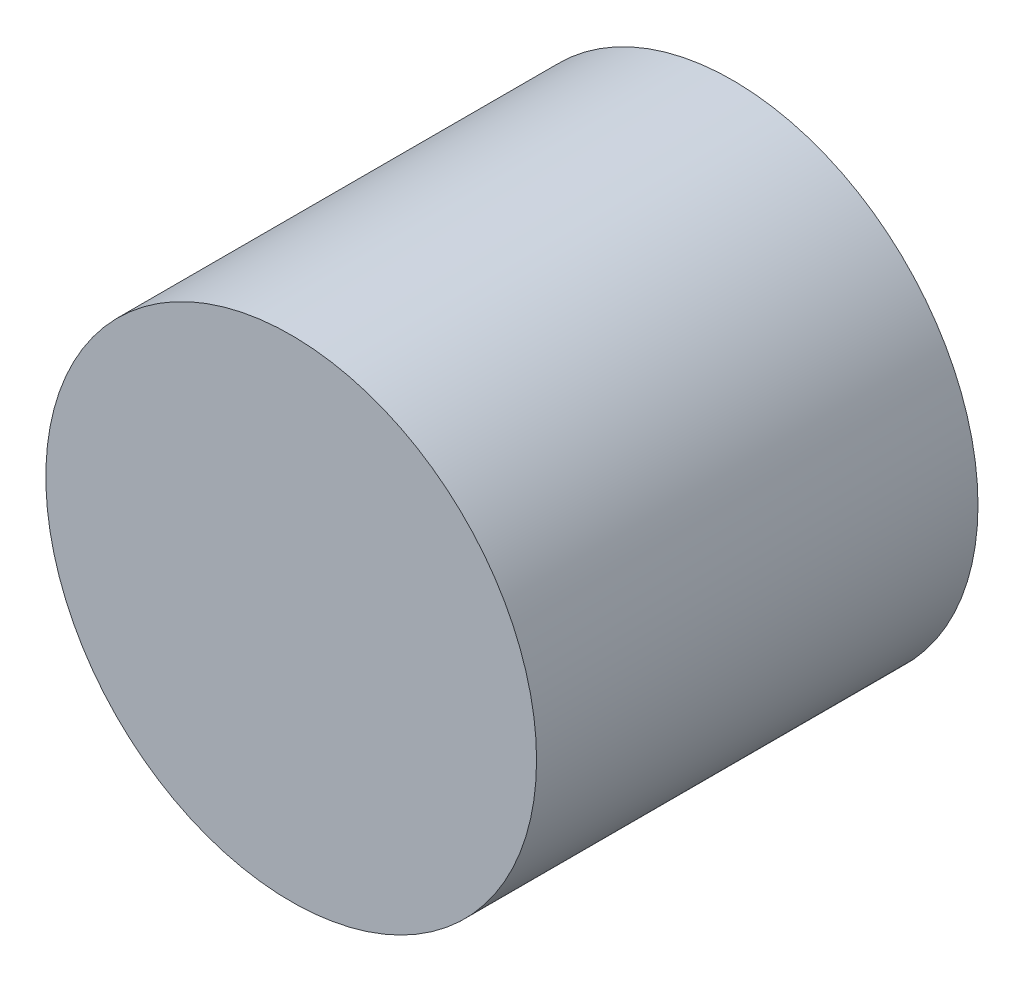
ISO-10303-21;
HEADER;
FILE_DESCRIPTION(('STEP AP214'),'2;1');
FILE_NAME('part.step','',(''),(''),'','','');
FILE_SCHEMA(('AUTOMOTIVE_DESIGN { 1 0 10303 214 1 1 1 1 }'));
ENDSEC;
DATA;
#1=APPLICATION_CONTEXT('core data for automotive mechanical design processes');
#2=APPLICATION_PROTOCOL_DEFINITION('international standard','automotive_design',2000,#1);
#3=PRODUCT_CONTEXT('',#1,'mechanical');
#4=PRODUCT('Part','Part','',(#3));
#5=PRODUCT_RELATED_PRODUCT_CATEGORY('part','',(#4));
#6=PRODUCT_DEFINITION_FORMATION('','',#4);
#7=PRODUCT_DEFINITION_CONTEXT('part definition',#1,'design');
#8=PRODUCT_DEFINITION('design','',#6,#7);
#9=PRODUCT_DEFINITION_SHAPE('','',#8);
#10=(LENGTH_UNIT() NAMED_UNIT(*) SI_UNIT(.MILLI.,.METRE.));
#11=(NAMED_UNIT(*) PLANE_ANGLE_UNIT() SI_UNIT($,.RADIAN.));
#12=(NAMED_UNIT(*) SI_UNIT($,.STERADIAN.) SOLID_ANGLE_UNIT());
#13=UNCERTAINTY_MEASURE_WITH_UNIT(LENGTH_MEASURE(1.E-05),#10,'distance_accuracy_value','');
#14=(GEOMETRIC_REPRESENTATION_CONTEXT(3) GLOBAL_UNCERTAINTY_ASSIGNED_CONTEXT((#13)) GLOBAL_UNIT_ASSIGNED_CONTEXT((#10,
#11,#12)) REPRESENTATION_CONTEXT('',''));
#15=CARTESIAN_POINT('',(0.,0.,0.));
#16=DIRECTION('',(0.,0.,1.));
#17=DIRECTION('',(1.,0.,0.));
#18=AXIS2_PLACEMENT_3D('',#15,#16,#17);
#19=CARTESIAN_POINT('',(0.,0.,68.5));
#20=DIRECTION('',(0.,0.,-1.));
#21=DIRECTION('',(-1.,0.,0.));
#22=AXIS2_PLACEMENT_3D('',#19,#20,#21);
#23=CYLINDRICAL_SURFACE('',#22,38.075);
#24=CARTESIAN_POINT('',(0.,0.,68.5));
#25=DIRECTION('',(0.,0.,1.));
#26=DIRECTION('',(1.,0.,0.));
#27=AXIS2_PLACEMENT_3D('',#24,#25,#26);
#28=CIRCLE('',#27,38.075);
#29=CARTESIAN_POINT('',(38.075,0.,68.5));
#30=VERTEX_POINT('',#29);
#31=EDGE_CURVE('E60',#30,#30,#28,.T.);
#32=ORIENTED_EDGE('',*,*,#31,.F.);
#33=EDGE_LOOP('',(#32));
#34=FACE_BOUND('',#33,.T.);
#35=CARTESIAN_POINT('',(0.,0.,0.));
#36=DIRECTION('',(0.,0.,1.));
#37=DIRECTION('',(1.,0.,0.));
#38=AXIS2_PLACEMENT_3D('',#35,#36,#37);
#39=CIRCLE('',#38,38.075);
#40=CARTESIAN_POINT('',(38.075,0.,0.));
#41=VERTEX_POINT('',#40);
#42=EDGE_CURVE('E65',#41,#41,#39,.T.);
#43=ORIENTED_EDGE('',*,*,#42,.T.);
#44=EDGE_LOOP('',(#43));
#45=FACE_BOUND('',#44,.T.);
#46=ADVANCED_FACE('F47',(#34,#45),#23,.T.);
#47=CARTESIAN_POINT('',(0.,0.,68.5));
#48=DIRECTION('',(0.,0.,1.));
#49=DIRECTION('',(1.,0.,0.));
#50=AXIS2_PLACEMENT_3D('',#47,#48,#49);
#51=PLANE('',#50);
#52=ORIENTED_EDGE('',*,*,#31,.T.);
#53=EDGE_LOOP('',(#52));
#54=FACE_BOUND('',#53,.T.);
#55=ADVANCED_FACE('F76',(#54),#51,.T.);
#56=CARTESIAN_POINT('',(0.,0.,0.));
#57=DIRECTION('',(0.,0.,1.));
#58=DIRECTION('',(1.,0.,0.));
#59=AXIS2_PLACEMENT_3D('',#56,#57,#58);
#60=PLANE('',#59);
#61=CARTESIAN_POINT('',(0.,0.,0.));
#62=DIRECTION('',(0.,0.,-1.));
#63=DIRECTION('',(-1.,0.,0.));
#64=AXIS2_PLACEMENT_3D('',#61,#62,#63);
#65=CIRCLE('',#64,21.075);
#66=CARTESIAN_POINT('',(-21.075,0.,0.));
#67=VERTEX_POINT('',#66);
#68=EDGE_CURVE('E55',#67,#67,#65,.T.);
#69=ORIENTED_EDGE('',*,*,#68,.F.);
#70=EDGE_LOOP('',(#69));
#71=FACE_BOUND('',#70,.T.);
#72=ORIENTED_EDGE('',*,*,#42,.F.);
#73=EDGE_LOOP('',(#72));
#74=FACE_BOUND('',#73,.T.);
#75=ADVANCED_FACE('F73',(#71,#74),#60,.F.);
#76=CARTESIAN_POINT('',(0.,0.,3.));
#77=DIRECTION('',(0.,0.,-1.));
#78=DIRECTION('',(-1.,0.,0.));
#79=AXIS2_PLACEMENT_3D('',#76,#77,#78);
#80=CYLINDRICAL_SURFACE('',#79,21.075);
#81=CARTESIAN_POINT('',(0.,0.,3.));
#82=DIRECTION('',(0.,0.,-1.));
#83=DIRECTION('',(-1.,0.,0.));
#84=AXIS2_PLACEMENT_3D('',#81,#82,#83);
#85=CIRCLE('',#84,21.075);
#86=CARTESIAN_POINT('',(-21.075,0.,3.));
#87=VERTEX_POINT('',#86);
#88=EDGE_CURVE('E11',#87,#87,#85,.T.);
#89=ORIENTED_EDGE('',*,*,#88,.F.);
#90=EDGE_LOOP('',(#89));
#91=FACE_BOUND('',#90,.T.);
#92=ORIENTED_EDGE('',*,*,#68,.T.);
#93=EDGE_LOOP('',(#92));
#94=FACE_BOUND('',#93,.T.);
#95=ADVANCED_FACE('F75',(#91,#94),#80,.F.);
#96=CARTESIAN_POINT('',(0.,0.,3.));
#97=DIRECTION('',(0.,0.,-1.));
#98=DIRECTION('',(-1.,0.,0.));
#99=AXIS2_PLACEMENT_3D('',#96,#97,#98);
#100=PLANE('',#99);
#101=ORIENTED_EDGE('',*,*,#88,.T.);
#102=EDGE_LOOP('',(#101));
#103=FACE_BOUND('',#102,.T.);
#104=ADVANCED_FACE('F49',(#103),#100,.T.);
#105=CLOSED_SHELL('',(#46,#55,#75,#95,#104));
#106=MANIFOLD_SOLID_BREP('B2',#105);
#107=CARTESIAN_POINT('',(0.,0.,-6.));
#108=DIRECTION('',(0.,0.,-1.));
#109=DIRECTION('',(-1.,0.,0.));
#110=AXIS2_PLACEMENT_3D('',#107,#108,#109);
#111=PLANE('',#110);
#112=CARTESIAN_POINT('',(0.,0.,-6.));
#113=DIRECTION('',(0.,0.,-1.));
#114=DIRECTION('',(-1.,0.,0.));
#115=AXIS2_PLACEMENT_3D('',#112,#113,#114);
#116=CIRCLE('',#115,9.50000000000001);
#117=CARTESIAN_POINT('',(-9.50000000000001,0.,-6.));
#118=VERTEX_POINT('',#117);
#119=EDGE_CURVE('E130',#118,#118,#116,.T.);
#120=ORIENTED_EDGE('',*,*,#119,.T.);
#121=EDGE_LOOP('',(#120));
#122=FACE_BOUND('',#121,.T.);
#123=ADVANCED_FACE('F122',(#122),#111,.T.);
#124=CARTESIAN_POINT('',(0.,0.,-6.));
#125=DIRECTION('',(0.,0.,1.));
#126=DIRECTION('',(1.,0.,0.));
#127=AXIS2_PLACEMENT_3D('',#124,#125,#126);
#128=CONICAL_SURFACE('',#127,9.50000000000001,0.785398163397449);
#129=CARTESIAN_POINT('',(0.,0.,-4.00000000000001));
#130=DIRECTION('',(0.,0.,-1.));
#131=DIRECTION('',(-1.,0.,0.));
#132=AXIS2_PLACEMENT_3D('',#129,#130,#131);
#133=CIRCLE('',#132,11.5);
#134=CARTESIAN_POINT('',(-11.5,0.,-4.00000000000001));
#135=VERTEX_POINT('',#134);
#136=EDGE_CURVE('E46',#135,#135,#133,.F.);
#137=ORIENTED_EDGE('',*,*,#136,.F.);
#138=EDGE_LOOP('',(#137));
#139=FACE_BOUND('',#138,.T.);
#140=ORIENTED_EDGE('',*,*,#119,.F.);
#141=EDGE_LOOP('',(#140));
#142=FACE_BOUND('',#141,.T.);
#143=ADVANCED_FACE('F125',(#139,#142),#128,.T.);
#144=CARTESIAN_POINT('',(0.,0.,-6.));
#145=DIRECTION('',(0.,0.,1.));
#146=DIRECTION('',(1.,0.,0.));
#147=AXIS2_PLACEMENT_3D('',#144,#145,#146);
#148=CYLINDRICAL_SURFACE('',#147,11.5);
#149=ORIENTED_EDGE('',*,*,#136,.T.);
#150=EDGE_LOOP('',(#149));
#151=FACE_BOUND('',#150,.T.);
#152=CARTESIAN_POINT('',(0.,0.,0.));
#153=DIRECTION('',(0.,0.,-1.));
#154=DIRECTION('',(-1.,0.,0.));
#155=AXIS2_PLACEMENT_3D('',#152,#153,#154);
#156=CIRCLE('',#155,11.5);
#157=CARTESIAN_POINT('',(-11.5,0.,0.));
#158=VERTEX_POINT('',#157);
#159=EDGE_CURVE('E134',#158,#158,#156,.T.);
#160=ORIENTED_EDGE('',*,*,#159,.T.);
#161=EDGE_LOOP('',(#160));
#162=FACE_BOUND('',#161,.T.);
#163=ADVANCED_FACE('F141',(#151,#162),#148,.T.);
#164=CARTESIAN_POINT('',(0.,0.,0.));
#165=DIRECTION('',(0.,0.,-1.));
#166=DIRECTION('',(-1.,0.,0.));
#167=AXIS2_PLACEMENT_3D('',#164,#165,#166);
#168=PLANE('',#167);
#169=ORIENTED_EDGE('',*,*,#159,.F.);
#170=EDGE_LOOP('',(#169));
#171=FACE_BOUND('',#170,.T.);
#172=ADVANCED_FACE('F143',(#171),#168,.F.);
#173=CLOSED_SHELL('',(#123,#143,#163,#172));
#174=MANIFOLD_SOLID_BREP('B6',#173);
#175=ADVANCED_BREP_SHAPE_REPRESENTATION('',(#18,#106,#174),#14);
#176=SHAPE_DEFINITION_REPRESENTATION(#9,#175);
ENDSEC;
END-ISO-10303-21;
